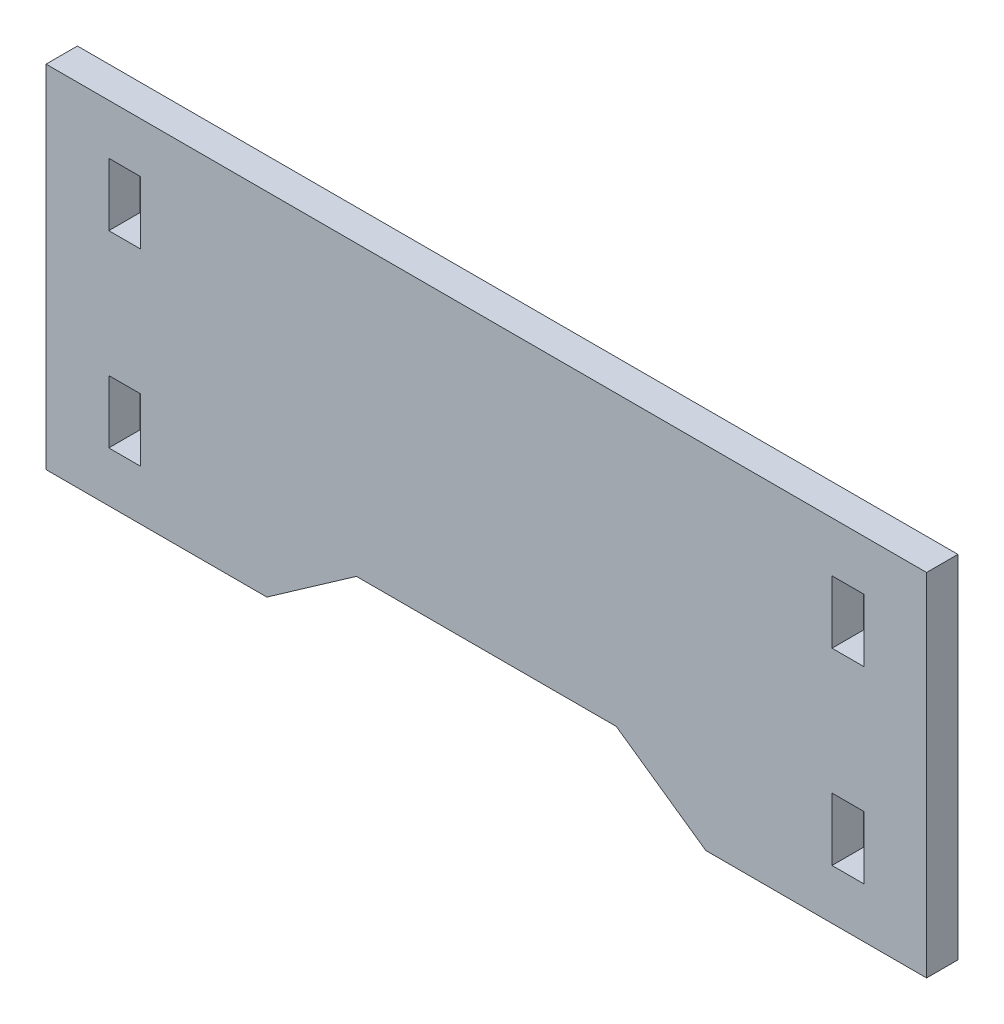
ISO-10303-21;
HEADER;
FILE_DESCRIPTION(('STEP AP214'),'2;1');
FILE_NAME('part.step','',(''),(''),'','','');
FILE_SCHEMA(('AUTOMOTIVE_DESIGN { 1 0 10303 214 1 1 1 1 }'));
ENDSEC;
DATA;
#1=APPLICATION_CONTEXT('core data for automotive mechanical design processes');
#2=APPLICATION_PROTOCOL_DEFINITION('international standard','automotive_design',2000,#1);
#3=PRODUCT_CONTEXT('',#1,'mechanical');
#4=PRODUCT('Part','Part','',(#3));
#5=PRODUCT_RELATED_PRODUCT_CATEGORY('part','',(#4));
#6=PRODUCT_DEFINITION_FORMATION('','',#4);
#7=PRODUCT_DEFINITION_CONTEXT('part definition',#1,'design');
#8=PRODUCT_DEFINITION('design','',#6,#7);
#9=PRODUCT_DEFINITION_SHAPE('','',#8);
#10=(LENGTH_UNIT() NAMED_UNIT(*) SI_UNIT(.MILLI.,.METRE.));
#11=(NAMED_UNIT(*) PLANE_ANGLE_UNIT() SI_UNIT($,.RADIAN.));
#12=(NAMED_UNIT(*) SI_UNIT($,.STERADIAN.) SOLID_ANGLE_UNIT());
#13=UNCERTAINTY_MEASURE_WITH_UNIT(LENGTH_MEASURE(1.E-05),#10,'distance_accuracy_value','');
#14=(GEOMETRIC_REPRESENTATION_CONTEXT(3) GLOBAL_UNCERTAINTY_ASSIGNED_CONTEXT((#13)) GLOBAL_UNIT_ASSIGNED_CONTEXT((#10,
#11,#12)) REPRESENTATION_CONTEXT('',''));
#15=CARTESIAN_POINT('',(0.,0.,0.));
#16=DIRECTION('',(0.,0.,1.));
#17=DIRECTION('',(1.,0.,0.));
#18=AXIS2_PLACEMENT_3D('',#15,#16,#17);
#19=CARTESIAN_POINT('',(-44.577,-17.78,3.175));
#20=DIRECTION('',(0.,1.,0.));
#21=DIRECTION('',(0.,0.,1.));
#22=AXIS2_PLACEMENT_3D('',#19,#20,#21);
#23=PLANE('',#22);
#24=DIRECTION('',(1.,0.,0.));
#25=VECTOR('',#24,1.);
#26=CARTESIAN_POINT('',(-44.577,-17.78,0.));
#27=LINE('',#26,#25);
#28=CARTESIAN_POINT('',(-44.577,-17.78,0.));
#29=VERTEX_POINT('',#28);
#30=CARTESIAN_POINT('',(-22.225,-17.78,0.));
#31=VERTEX_POINT('',#30);
#32=EDGE_CURVE('E215',#29,#31,#27,.T.);
#33=ORIENTED_EDGE('',*,*,#32,.T.);
#34=DIRECTION('',(0.,0.,1.));
#35=VECTOR('',#34,1.);
#36=CARTESIAN_POINT('',(-22.225,-17.78,0.));
#37=LINE('',#36,#35);
#38=CARTESIAN_POINT('',(-22.225,-17.78,3.175));
#39=VERTEX_POINT('',#38);
#40=EDGE_CURVE('E196',#31,#39,#37,.T.);
#41=ORIENTED_EDGE('',*,*,#40,.T.);
#42=DIRECTION('',(1.,0.,0.));
#43=VECTOR('',#42,1.);
#44=CARTESIAN_POINT('',(-44.577,-17.78,3.175));
#45=LINE('',#44,#43);
#46=CARTESIAN_POINT('',(-44.577,-17.78,3.175));
#47=VERTEX_POINT('',#46);
#48=EDGE_CURVE('E235',#47,#39,#45,.T.);
#49=ORIENTED_EDGE('',*,*,#48,.F.);
#50=DIRECTION('',(0.,0.,-1.));
#51=VECTOR('',#50,1.);
#52=CARTESIAN_POINT('',(-44.577,-17.78,3.175));
#53=LINE('',#52,#51);
#54=EDGE_CURVE('E221',#47,#29,#53,.T.);
#55=ORIENTED_EDGE('',*,*,#54,.T.);
#56=EDGE_LOOP('',(#33,#41,#49,#55));
#57=FACE_BOUND('',#56,.T.);
#58=ADVANCED_FACE('F33',(#57),#23,.F.);
#59=CARTESIAN_POINT('',(44.577,17.78,3.175));
#60=DIRECTION('',(0.,0.,-1.));
#61=DIRECTION('',(-1.,0.,0.));
#62=AXIS2_PLACEMENT_3D('',#59,#60,#61);
#63=PLANE('',#62);
#64=DIRECTION('',(0.,1.,0.));
#65=VECTOR('',#64,1.);
#66=CARTESIAN_POINT('',(35.0012,12.7,3.175));
#67=LINE('',#66,#65);
#68=CARTESIAN_POINT('',(35.0012,6.35,3.175));
#69=VERTEX_POINT('',#68);
#70=CARTESIAN_POINT('',(35.0012,12.7,3.175));
#71=VERTEX_POINT('',#70);
#72=EDGE_CURVE('E338',#69,#71,#67,.T.);
#73=ORIENTED_EDGE('',*,*,#72,.T.);
#74=DIRECTION('',(1.,0.,0.));
#75=VECTOR('',#74,1.);
#76=CARTESIAN_POINT('',(38.227,12.7,3.175));
#77=LINE('',#76,#75);
#78=CARTESIAN_POINT('',(38.227,12.7,3.175));
#79=VERTEX_POINT('',#78);
#80=EDGE_CURVE('E328',#71,#79,#77,.T.);
#81=ORIENTED_EDGE('',*,*,#80,.T.);
#82=DIRECTION('',(0.,-1.,0.));
#83=VECTOR('',#82,1.);
#84=CARTESIAN_POINT('',(38.227,12.7,3.175));
#85=LINE('',#84,#83);
#86=CARTESIAN_POINT('',(38.227,6.35,3.175));
#87=VERTEX_POINT('',#86);
#88=EDGE_CURVE('E332',#79,#87,#85,.T.);
#89=ORIENTED_EDGE('',*,*,#88,.T.);
#90=DIRECTION('',(-1.,0.,0.));
#91=VECTOR('',#90,1.);
#92=CARTESIAN_POINT('',(38.227,6.35,3.175));
#93=LINE('',#92,#91);
#94=EDGE_CURVE('E335',#87,#69,#93,.T.);
#95=ORIENTED_EDGE('',*,*,#94,.T.);
#96=EDGE_LOOP('',(#73,#81,#89,#95));
#97=FACE_BOUND('',#96,.T.);
#98=DIRECTION('',(-1.,0.,0.));
#99=VECTOR('',#98,1.);
#100=CARTESIAN_POINT('',(-38.227,-6.35,3.175));
#101=LINE('',#100,#99);
#102=CARTESIAN_POINT('',(-35.0012,-6.35,3.175));
#103=VERTEX_POINT('',#102);
#104=CARTESIAN_POINT('',(-38.227,-6.35,3.175));
#105=VERTEX_POINT('',#104);
#106=EDGE_CURVE('E302',#103,#105,#101,.T.);
#107=ORIENTED_EDGE('',*,*,#106,.F.);
#108=DIRECTION('',(0.,1.,0.));
#109=VECTOR('',#108,1.);
#110=CARTESIAN_POINT('',(-35.0012,-6.35,3.175));
#111=LINE('',#110,#109);
#112=CARTESIAN_POINT('',(-35.0012,-12.7,3.175));
#113=VERTEX_POINT('',#112);
#114=EDGE_CURVE('E305',#113,#103,#111,.T.);
#115=ORIENTED_EDGE('',*,*,#114,.F.);
#116=DIRECTION('',(1.,0.,0.));
#117=VECTOR('',#116,1.);
#118=CARTESIAN_POINT('',(-38.227,-12.7,3.175));
#119=LINE('',#118,#117);
#120=CARTESIAN_POINT('',(-38.227,-12.7,3.175));
#121=VERTEX_POINT('',#120);
#122=EDGE_CURVE('E295',#121,#113,#119,.T.);
#123=ORIENTED_EDGE('',*,*,#122,.F.);
#124=DIRECTION('',(0.,-1.,0.));
#125=VECTOR('',#124,1.);
#126=CARTESIAN_POINT('',(-38.227,-6.35,3.175));
#127=LINE('',#126,#125);
#128=EDGE_CURVE('E299',#105,#121,#127,.T.);
#129=ORIENTED_EDGE('',*,*,#128,.F.);
#130=EDGE_LOOP('',(#107,#115,#123,#129));
#131=FACE_BOUND('',#130,.T.);
#132=DIRECTION('',(-1.,0.,0.));
#133=VECTOR('',#132,1.);
#134=CARTESIAN_POINT('',(-38.227,12.7,3.175));
#135=LINE('',#134,#133);
#136=CARTESIAN_POINT('',(-35.0012,12.7,3.175));
#137=VERTEX_POINT('',#136);
#138=CARTESIAN_POINT('',(-38.227,12.7,3.175));
#139=VERTEX_POINT('',#138);
#140=EDGE_CURVE('E270',#137,#139,#135,.T.);
#141=ORIENTED_EDGE('',*,*,#140,.F.);
#142=DIRECTION('',(0.,1.,0.));
#143=VECTOR('',#142,1.);
#144=CARTESIAN_POINT('',(-35.0012,12.7,3.175));
#145=LINE('',#144,#143);
#146=CARTESIAN_POINT('',(-35.0012,6.35,3.175));
#147=VERTEX_POINT('',#146);
#148=EDGE_CURVE('E273',#147,#137,#145,.T.);
#149=ORIENTED_EDGE('',*,*,#148,.F.);
#150=DIRECTION('',(1.,0.,0.));
#151=VECTOR('',#150,1.);
#152=CARTESIAN_POINT('',(-38.227,6.35,3.175));
#153=LINE('',#152,#151);
#154=CARTESIAN_POINT('',(-38.227,6.35,3.175));
#155=VERTEX_POINT('',#154);
#156=EDGE_CURVE('E263',#155,#147,#153,.T.);
#157=ORIENTED_EDGE('',*,*,#156,.F.);
#158=DIRECTION('',(0.,-1.,0.));
#159=VECTOR('',#158,1.);
#160=CARTESIAN_POINT('',(-38.227,12.7,3.175));
#161=LINE('',#160,#159);
#162=EDGE_CURVE('E267',#139,#155,#161,.T.);
#163=ORIENTED_EDGE('',*,*,#162,.F.);
#164=EDGE_LOOP('',(#141,#149,#157,#163));
#165=FACE_BOUND('',#164,.T.);
#166=ORIENTED_EDGE('',*,*,#48,.T.);
#167=DIRECTION('',(-0.819152044288995,-0.573576436351042,0.));
#168=VECTOR('',#167,1.);
#169=CARTESIAN_POINT('',(-13.1562601571874,-11.43,3.175));
#170=LINE('',#169,#168);
#171=CARTESIAN_POINT('',(-13.1562601571874,-11.43,3.175));
#172=VERTEX_POINT('',#171);
#173=EDGE_CURVE('E202',#172,#39,#170,.T.);
#174=ORIENTED_EDGE('',*,*,#173,.F.);
#175=DIRECTION('',(-1.,0.,0.));
#176=VECTOR('',#175,1.);
#177=CARTESIAN_POINT('',(-13.1562601571874,-11.43,3.175));
#178=LINE('',#177,#176);
#179=CARTESIAN_POINT('',(13.1562601571874,-11.43,3.175));
#180=VERTEX_POINT('',#179);
#181=EDGE_CURVE('E217',#180,#172,#178,.T.);
#182=ORIENTED_EDGE('',*,*,#181,.F.);
#183=DIRECTION('',(-0.819152044288995,0.573576436351041,0.));
#184=VECTOR('',#183,1.);
#185=CARTESIAN_POINT('',(22.225,-17.78,3.175));
#186=LINE('',#185,#184);
#187=CARTESIAN_POINT('',(22.225,-17.78,3.175));
#188=VERTEX_POINT('',#187);
#189=EDGE_CURVE('E382',#188,#180,#186,.T.);
#190=ORIENTED_EDGE('',*,*,#189,.F.);
#191=CARTESIAN_POINT('',(44.577,-17.78,3.175));
#192=VERTEX_POINT('',#191);
#193=EDGE_CURVE('E251',#188,#192,#45,.T.);
#194=ORIENTED_EDGE('',*,*,#193,.T.);
#195=DIRECTION('',(0.,1.,0.));
#196=VECTOR('',#195,1.);
#197=CARTESIAN_POINT('',(44.577,-17.78,3.175));
#198=LINE('',#197,#196);
#199=CARTESIAN_POINT('',(44.577,17.78,3.175));
#200=VERTEX_POINT('',#199);
#201=EDGE_CURVE('E222',#192,#200,#198,.T.);
#202=ORIENTED_EDGE('',*,*,#201,.T.);
#203=DIRECTION('',(-1.,0.,0.));
#204=VECTOR('',#203,1.);
#205=CARTESIAN_POINT('',(-44.577,17.78,3.175));
#206=LINE('',#205,#204);
#207=CARTESIAN_POINT('',(-44.577,17.78,3.175));
#208=VERTEX_POINT('',#207);
#209=EDGE_CURVE('E226',#200,#208,#206,.T.);
#210=ORIENTED_EDGE('',*,*,#209,.T.);
#211=DIRECTION('',(0.,-1.,0.));
#212=VECTOR('',#211,1.);
#213=CARTESIAN_POINT('',(-44.577,-17.78,3.175));
#214=LINE('',#213,#212);
#215=EDGE_CURVE('E241',#208,#47,#214,.T.);
#216=ORIENTED_EDGE('',*,*,#215,.T.);
#217=EDGE_LOOP('',(#166,#174,#182,#190,#194,#202,#210,#216));
#218=FACE_BOUND('',#217,.T.);
#219=DIRECTION('',(0.,1.,0.));
#220=VECTOR('',#219,1.);
#221=CARTESIAN_POINT('',(35.0012,-6.35,3.175));
#222=LINE('',#221,#220);
#223=CARTESIAN_POINT('',(35.0012,-12.7,3.175));
#224=VERTEX_POINT('',#223);
#225=CARTESIAN_POINT('',(35.0012,-6.35,3.175));
#226=VERTEX_POINT('',#225);
#227=EDGE_CURVE('E56',#224,#226,#222,.T.);
#228=ORIENTED_EDGE('',*,*,#227,.T.);
#229=DIRECTION('',(1.,0.,0.));
#230=VECTOR('',#229,1.);
#231=CARTESIAN_POINT('',(38.227,-6.35,3.175));
#232=LINE('',#231,#230);
#233=CARTESIAN_POINT('',(38.227,-6.35,3.175));
#234=VERTEX_POINT('',#233);
#235=EDGE_CURVE('E357',#226,#234,#232,.T.);
#236=ORIENTED_EDGE('',*,*,#235,.T.);
#237=DIRECTION('',(0.,-1.,0.));
#238=VECTOR('',#237,1.);
#239=CARTESIAN_POINT('',(38.227,-6.35,3.175));
#240=LINE('',#239,#238);
#241=CARTESIAN_POINT('',(38.227,-12.7,3.175));
#242=VERTEX_POINT('',#241);
#243=EDGE_CURVE('E361',#234,#242,#240,.T.);
#244=ORIENTED_EDGE('',*,*,#243,.T.);
#245=DIRECTION('',(-1.,0.,0.));
#246=VECTOR('',#245,1.);
#247=CARTESIAN_POINT('',(38.227,-12.7,3.175));
#248=LINE('',#247,#246);
#249=EDGE_CURVE('E364',#242,#224,#248,.T.);
#250=ORIENTED_EDGE('',*,*,#249,.T.);
#251=EDGE_LOOP('',(#228,#236,#244,#250));
#252=FACE_BOUND('',#251,.T.);
#253=ADVANCED_FACE('F396',(#97,#131,#165,#218,#252),#63,.F.);
#254=CARTESIAN_POINT('',(44.577,17.78,0.));
#255=DIRECTION('',(0.,0.,-1.));
#256=DIRECTION('',(-1.,0.,0.));
#257=AXIS2_PLACEMENT_3D('',#254,#255,#256);
#258=PLANE('',#257);
#259=DIRECTION('',(-0.819152044288995,-0.573576436351042,0.));
#260=VECTOR('',#259,1.);
#261=CARTESIAN_POINT('',(-13.1562601571874,-11.43,0.));
#262=LINE('',#261,#260);
#263=CARTESIAN_POINT('',(-13.1562601571874,-11.43,0.));
#264=VERTEX_POINT('',#263);
#265=EDGE_CURVE('E199',#264,#31,#262,.T.);
#266=ORIENTED_EDGE('',*,*,#265,.T.);
#267=ORIENTED_EDGE('',*,*,#32,.F.);
#268=DIRECTION('',(0.,-1.,0.));
#269=VECTOR('',#268,1.);
#270=CARTESIAN_POINT('',(-44.577,-17.78,0.));
#271=LINE('',#270,#269);
#272=CARTESIAN_POINT('',(-44.577,17.78,0.));
#273=VERTEX_POINT('',#272);
#274=EDGE_CURVE('E228',#273,#29,#271,.T.);
#275=ORIENTED_EDGE('',*,*,#274,.F.);
#276=DIRECTION('',(-1.,0.,0.));
#277=VECTOR('',#276,1.);
#278=CARTESIAN_POINT('',(-44.577,17.78,0.));
#279=LINE('',#278,#277);
#280=CARTESIAN_POINT('',(44.577,17.78,0.));
#281=VERTEX_POINT('',#280);
#282=EDGE_CURVE('E244',#281,#273,#279,.T.);
#283=ORIENTED_EDGE('',*,*,#282,.F.);
#284=DIRECTION('',(0.,1.,0.));
#285=VECTOR('',#284,1.);
#286=CARTESIAN_POINT('',(44.577,-17.78,0.));
#287=LINE('',#286,#285);
#288=CARTESIAN_POINT('',(44.577,-17.78,0.));
#289=VERTEX_POINT('',#288);
#290=EDGE_CURVE('E245',#289,#281,#287,.T.);
#291=ORIENTED_EDGE('',*,*,#290,.F.);
#292=CARTESIAN_POINT('',(22.225,-17.78,0.));
#293=VERTEX_POINT('',#292);
#294=EDGE_CURVE('E223',#293,#289,#27,.T.);
#295=ORIENTED_EDGE('',*,*,#294,.F.);
#296=DIRECTION('',(-0.819152044288995,0.573576436351041,0.));
#297=VECTOR('',#296,1.);
#298=CARTESIAN_POINT('',(22.225,-17.78,0.));
#299=LINE('',#298,#297);
#300=CARTESIAN_POINT('',(13.1562601571874,-11.43,0.));
#301=VERTEX_POINT('',#300);
#302=EDGE_CURVE('E48',#293,#301,#299,.T.);
#303=ORIENTED_EDGE('',*,*,#302,.T.);
#304=DIRECTION('',(-1.,0.,0.));
#305=VECTOR('',#304,1.);
#306=CARTESIAN_POINT('',(-13.1562601571874,-11.43,0.));
#307=LINE('',#306,#305);
#308=EDGE_CURVE('E208',#301,#264,#307,.T.);
#309=ORIENTED_EDGE('',*,*,#308,.T.);
#310=EDGE_LOOP('',(#266,#267,#275,#283,#291,#295,#303,#309));
#311=FACE_BOUND('',#310,.T.);
#312=DIRECTION('',(1.,0.,0.));
#313=VECTOR('',#312,1.);
#314=CARTESIAN_POINT('',(38.227,12.7,0.));
#315=LINE('',#314,#313);
#316=CARTESIAN_POINT('',(35.0012,12.7,0.));
#317=VERTEX_POINT('',#316);
#318=CARTESIAN_POINT('',(38.227,12.7,0.));
#319=VERTEX_POINT('',#318);
#320=EDGE_CURVE('E322',#317,#319,#315,.T.);
#321=ORIENTED_EDGE('',*,*,#320,.F.);
#322=DIRECTION('',(0.,1.,0.));
#323=VECTOR('',#322,1.);
#324=CARTESIAN_POINT('',(35.0012,12.7,0.));
#325=LINE('',#324,#323);
#326=CARTESIAN_POINT('',(35.0012,6.35,0.));
#327=VERTEX_POINT('',#326);
#328=EDGE_CURVE('E331',#327,#317,#325,.T.);
#329=ORIENTED_EDGE('',*,*,#328,.F.);
#330=DIRECTION('',(-1.,0.,0.));
#331=VECTOR('',#330,1.);
#332=CARTESIAN_POINT('',(38.227,6.35,0.));
#333=LINE('',#332,#331);
#334=CARTESIAN_POINT('',(38.227,6.35,0.));
#335=VERTEX_POINT('',#334);
#336=EDGE_CURVE('E346',#335,#327,#333,.T.);
#337=ORIENTED_EDGE('',*,*,#336,.F.);
#338=DIRECTION('',(0.,-1.,0.));
#339=VECTOR('',#338,1.);
#340=CARTESIAN_POINT('',(38.227,12.7,0.));
#341=LINE('',#340,#339);
#342=EDGE_CURVE('E343',#319,#335,#341,.T.);
#343=ORIENTED_EDGE('',*,*,#342,.F.);
#344=EDGE_LOOP('',(#321,#329,#337,#343));
#345=FACE_BOUND('',#344,.T.);
#346=DIRECTION('',(0.,1.,0.));
#347=VECTOR('',#346,1.);
#348=CARTESIAN_POINT('',(-35.0012,-6.35,0.));
#349=LINE('',#348,#347);
#350=CARTESIAN_POINT('',(-35.0012,-12.7,0.));
#351=VERTEX_POINT('',#350);
#352=CARTESIAN_POINT('',(-35.0012,-6.35,0.));
#353=VERTEX_POINT('',#352);
#354=EDGE_CURVE('E298',#351,#353,#349,.T.);
#355=ORIENTED_EDGE('',*,*,#354,.T.);
#356=DIRECTION('',(-1.,0.,0.));
#357=VECTOR('',#356,1.);
#358=CARTESIAN_POINT('',(-38.227,-6.35,0.));
#359=LINE('',#358,#357);
#360=CARTESIAN_POINT('',(-38.227,-6.35,0.));
#361=VERTEX_POINT('',#360);
#362=EDGE_CURVE('E313',#353,#361,#359,.T.);
#363=ORIENTED_EDGE('',*,*,#362,.T.);
#364=DIRECTION('',(0.,-1.,0.));
#365=VECTOR('',#364,1.);
#366=CARTESIAN_POINT('',(-38.227,-6.35,0.));
#367=LINE('',#366,#365);
#368=CARTESIAN_POINT('',(-38.227,-12.7,0.));
#369=VERTEX_POINT('',#368);
#370=EDGE_CURVE('E310',#361,#369,#367,.T.);
#371=ORIENTED_EDGE('',*,*,#370,.T.);
#372=DIRECTION('',(1.,0.,0.));
#373=VECTOR('',#372,1.);
#374=CARTESIAN_POINT('',(-38.227,-12.7,0.));
#375=LINE('',#374,#373);
#376=EDGE_CURVE('E290',#369,#351,#375,.T.);
#377=ORIENTED_EDGE('',*,*,#376,.T.);
#378=EDGE_LOOP('',(#355,#363,#371,#377));
#379=FACE_BOUND('',#378,.T.);
#380=DIRECTION('',(0.,1.,0.));
#381=VECTOR('',#380,1.);
#382=CARTESIAN_POINT('',(-35.0012,12.7,0.));
#383=LINE('',#382,#381);
#384=CARTESIAN_POINT('',(-35.0012,6.35,0.));
#385=VERTEX_POINT('',#384);
#386=CARTESIAN_POINT('',(-35.0012,12.7,0.));
#387=VERTEX_POINT('',#386);
#388=EDGE_CURVE('E266',#385,#387,#383,.T.);
#389=ORIENTED_EDGE('',*,*,#388,.T.);
#390=DIRECTION('',(-1.,0.,0.));
#391=VECTOR('',#390,1.);
#392=CARTESIAN_POINT('',(-38.227,12.7,0.));
#393=LINE('',#392,#391);
#394=CARTESIAN_POINT('',(-38.227,12.7,0.));
#395=VERTEX_POINT('',#394);
#396=EDGE_CURVE('E281',#387,#395,#393,.T.);
#397=ORIENTED_EDGE('',*,*,#396,.T.);
#398=DIRECTION('',(0.,-1.,0.));
#399=VECTOR('',#398,1.);
#400=CARTESIAN_POINT('',(-38.227,12.7,0.));
#401=LINE('',#400,#399);
#402=CARTESIAN_POINT('',(-38.227,6.35,0.));
#403=VERTEX_POINT('',#402);
#404=EDGE_CURVE('E278',#395,#403,#401,.T.);
#405=ORIENTED_EDGE('',*,*,#404,.T.);
#406=DIRECTION('',(1.,0.,0.));
#407=VECTOR('',#406,1.);
#408=CARTESIAN_POINT('',(-38.227,6.35,0.));
#409=LINE('',#408,#407);
#410=EDGE_CURVE('E258',#403,#385,#409,.T.);
#411=ORIENTED_EDGE('',*,*,#410,.T.);
#412=EDGE_LOOP('',(#389,#397,#405,#411));
#413=FACE_BOUND('',#412,.T.);
#414=DIRECTION('',(1.,0.,0.));
#415=VECTOR('',#414,1.);
#416=CARTESIAN_POINT('',(38.227,-6.35,0.));
#417=LINE('',#416,#415);
#418=CARTESIAN_POINT('',(35.0012,-6.35,0.));
#419=VERTEX_POINT('',#418);
#420=CARTESIAN_POINT('',(38.227,-6.35,0.));
#421=VERTEX_POINT('',#420);
#422=EDGE_CURVE('E352',#419,#421,#417,.T.);
#423=ORIENTED_EDGE('',*,*,#422,.F.);
#424=DIRECTION('',(0.,1.,0.));
#425=VECTOR('',#424,1.);
#426=CARTESIAN_POINT('',(35.0012,-6.35,0.));
#427=LINE('',#426,#425);
#428=CARTESIAN_POINT('',(35.0012,-12.7,0.));
#429=VERTEX_POINT('',#428);
#430=EDGE_CURVE('E360',#429,#419,#427,.T.);
#431=ORIENTED_EDGE('',*,*,#430,.F.);
#432=DIRECTION('',(-1.,0.,0.));
#433=VECTOR('',#432,1.);
#434=CARTESIAN_POINT('',(38.227,-12.7,0.));
#435=LINE('',#434,#433);
#436=CARTESIAN_POINT('',(38.227,-12.7,0.));
#437=VERTEX_POINT('',#436);
#438=EDGE_CURVE('E373',#437,#429,#435,.T.);
#439=ORIENTED_EDGE('',*,*,#438,.F.);
#440=DIRECTION('',(0.,-1.,0.));
#441=VECTOR('',#440,1.);
#442=CARTESIAN_POINT('',(38.227,-6.35,0.));
#443=LINE('',#442,#441);
#444=EDGE_CURVE('E370',#421,#437,#443,.T.);
#445=ORIENTED_EDGE('',*,*,#444,.F.);
#446=EDGE_LOOP('',(#423,#431,#439,#445));
#447=FACE_BOUND('',#446,.T.);
#448=ADVANCED_FACE('F212',(#311,#345,#379,#413,#447),#258,.T.);
#449=CARTESIAN_POINT('',(44.577,-17.78,3.175));
#450=DIRECTION('',(-1.,0.,0.));
#451=DIRECTION('',(0.,0.,1.));
#452=AXIS2_PLACEMENT_3D('',#449,#450,#451);
#453=PLANE('',#452);
#454=ORIENTED_EDGE('',*,*,#290,.T.);
#455=DIRECTION('',(0.,0.,-1.));
#456=VECTOR('',#455,1.);
#457=CARTESIAN_POINT('',(44.577,17.78,3.175));
#458=LINE('',#457,#456);
#459=EDGE_CURVE('E11',#200,#281,#458,.T.);
#460=ORIENTED_EDGE('',*,*,#459,.F.);
#461=ORIENTED_EDGE('',*,*,#201,.F.);
#462=DIRECTION('',(0.,0.,-1.));
#463=VECTOR('',#462,1.);
#464=CARTESIAN_POINT('',(44.577,-17.78,3.175));
#465=LINE('',#464,#463);
#466=EDGE_CURVE('E232',#192,#289,#465,.T.);
#467=ORIENTED_EDGE('',*,*,#466,.T.);
#468=EDGE_LOOP('',(#454,#460,#461,#467));
#469=FACE_BOUND('',#468,.T.);
#470=ADVANCED_FACE('F35',(#469),#453,.F.);
#471=CARTESIAN_POINT('',(-44.577,17.78,3.175));
#472=DIRECTION('',(0.,-1.,0.));
#473=DIRECTION('',(0.,0.,-1.));
#474=AXIS2_PLACEMENT_3D('',#471,#472,#473);
#475=PLANE('',#474);
#476=ORIENTED_EDGE('',*,*,#282,.T.);
#477=DIRECTION('',(0.,0.,-1.));
#478=VECTOR('',#477,1.);
#479=CARTESIAN_POINT('',(-44.577,17.78,3.175));
#480=LINE('',#479,#478);
#481=EDGE_CURVE('E41',#208,#273,#480,.T.);
#482=ORIENTED_EDGE('',*,*,#481,.F.);
#483=ORIENTED_EDGE('',*,*,#209,.F.);
#484=ORIENTED_EDGE('',*,*,#459,.T.);
#485=EDGE_LOOP('',(#476,#482,#483,#484));
#486=FACE_BOUND('',#485,.T.);
#487=ADVANCED_FACE('F430',(#486),#475,.F.);
#488=CARTESIAN_POINT('',(-44.577,-17.78,3.175));
#489=DIRECTION('',(1.,0.,0.));
#490=DIRECTION('',(0.,0.,-1.));
#491=AXIS2_PLACEMENT_3D('',#488,#489,#490);
#492=PLANE('',#491);
#493=ORIENTED_EDGE('',*,*,#274,.T.);
#494=ORIENTED_EDGE('',*,*,#54,.F.);
#495=ORIENTED_EDGE('',*,*,#215,.F.);
#496=ORIENTED_EDGE('',*,*,#481,.T.);
#497=EDGE_LOOP('',(#493,#494,#495,#496));
#498=FACE_BOUND('',#497,.T.);
#499=ADVANCED_FACE('F240',(#498),#492,.F.);
#500=ORIENTED_EDGE('',*,*,#193,.F.);
#501=DIRECTION('',(0.,0.,1.));
#502=VECTOR('',#501,1.);
#503=CARTESIAN_POINT('',(22.225,-17.78,0.));
#504=LINE('',#503,#502);
#505=EDGE_CURVE('E207',#293,#188,#504,.T.);
#506=ORIENTED_EDGE('',*,*,#505,.F.);
#507=ORIENTED_EDGE('',*,*,#294,.T.);
#508=ORIENTED_EDGE('',*,*,#466,.F.);
#509=EDGE_LOOP('',(#500,#506,#507,#508));
#510=FACE_BOUND('',#509,.T.);
#511=ADVANCED_FACE('F391',(#510),#23,.F.);
#512=CARTESIAN_POINT('',(-35.0012,12.7,0.));
#513=DIRECTION('',(1.,0.,0.));
#514=DIRECTION('',(0.,0.,-1.));
#515=AXIS2_PLACEMENT_3D('',#512,#513,#514);
#516=PLANE('',#515);
#517=ORIENTED_EDGE('',*,*,#148,.T.);
#518=DIRECTION('',(0.,0.,1.));
#519=VECTOR('',#518,1.);
#520=CARTESIAN_POINT('',(-35.0012,12.7,0.));
#521=LINE('',#520,#519);
#522=EDGE_CURVE('E254',#387,#137,#521,.T.);
#523=ORIENTED_EDGE('',*,*,#522,.F.);
#524=ORIENTED_EDGE('',*,*,#388,.F.);
#525=DIRECTION('',(0.,0.,1.));
#526=VECTOR('',#525,1.);
#527=CARTESIAN_POINT('',(-35.0012,6.35,0.));
#528=LINE('',#527,#526);
#529=EDGE_CURVE('E247',#385,#147,#528,.T.);
#530=ORIENTED_EDGE('',*,*,#529,.T.);
#531=EDGE_LOOP('',(#517,#523,#524,#530));
#532=FACE_BOUND('',#531,.T.);
#533=ADVANCED_FACE('F422',(#532),#516,.F.);
#534=CARTESIAN_POINT('',(-38.227,6.35,0.));
#535=DIRECTION('',(0.,-1.,0.));
#536=DIRECTION('',(0.,0.,-1.));
#537=AXIS2_PLACEMENT_3D('',#534,#535,#536);
#538=PLANE('',#537);
#539=ORIENTED_EDGE('',*,*,#156,.T.);
#540=ORIENTED_EDGE('',*,*,#529,.F.);
#541=ORIENTED_EDGE('',*,*,#410,.F.);
#542=DIRECTION('',(0.,0.,1.));
#543=VECTOR('',#542,1.);
#544=CARTESIAN_POINT('',(-38.227,6.35,0.));
#545=LINE('',#544,#543);
#546=EDGE_CURVE('E260',#403,#155,#545,.T.);
#547=ORIENTED_EDGE('',*,*,#546,.T.);
#548=EDGE_LOOP('',(#539,#540,#541,#547));
#549=FACE_BOUND('',#548,.T.);
#550=ADVANCED_FACE('F427',(#549),#538,.F.);
#551=CARTESIAN_POINT('',(-38.227,12.7,0.));
#552=DIRECTION('',(-1.,0.,0.));
#553=DIRECTION('',(0.,0.,1.));
#554=AXIS2_PLACEMENT_3D('',#551,#552,#553);
#555=PLANE('',#554);
#556=ORIENTED_EDGE('',*,*,#162,.T.);
#557=ORIENTED_EDGE('',*,*,#546,.F.);
#558=ORIENTED_EDGE('',*,*,#404,.F.);
#559=DIRECTION('',(0.,0.,1.));
#560=VECTOR('',#559,1.);
#561=CARTESIAN_POINT('',(-38.227,12.7,0.));
#562=LINE('',#561,#560);
#563=EDGE_CURVE('E257',#395,#139,#562,.T.);
#564=ORIENTED_EDGE('',*,*,#563,.T.);
#565=EDGE_LOOP('',(#556,#557,#558,#564));
#566=FACE_BOUND('',#565,.T.);
#567=ADVANCED_FACE('F447',(#566),#555,.F.);
#568=CARTESIAN_POINT('',(-38.227,12.7,0.));
#569=DIRECTION('',(0.,1.,0.));
#570=DIRECTION('',(0.,0.,1.));
#571=AXIS2_PLACEMENT_3D('',#568,#569,#570);
#572=PLANE('',#571);
#573=ORIENTED_EDGE('',*,*,#140,.T.);
#574=ORIENTED_EDGE('',*,*,#563,.F.);
#575=ORIENTED_EDGE('',*,*,#396,.F.);
#576=ORIENTED_EDGE('',*,*,#522,.T.);
#577=EDGE_LOOP('',(#573,#574,#575,#576));
#578=FACE_BOUND('',#577,.T.);
#579=ADVANCED_FACE('F443',(#578),#572,.F.);
#580=CARTESIAN_POINT('',(-35.0012,-6.35,0.));
#581=DIRECTION('',(1.,0.,0.));
#582=DIRECTION('',(0.,0.,-1.));
#583=AXIS2_PLACEMENT_3D('',#580,#581,#582);
#584=PLANE('',#583);
#585=ORIENTED_EDGE('',*,*,#114,.T.);
#586=DIRECTION('',(0.,0.,1.));
#587=VECTOR('',#586,1.);
#588=CARTESIAN_POINT('',(-35.0012,-6.35,0.));
#589=LINE('',#588,#587);
#590=EDGE_CURVE('E286',#353,#103,#589,.T.);
#591=ORIENTED_EDGE('',*,*,#590,.F.);
#592=ORIENTED_EDGE('',*,*,#354,.F.);
#593=DIRECTION('',(0.,0.,1.));
#594=VECTOR('',#593,1.);
#595=CARTESIAN_POINT('',(-35.0012,-12.7,0.));
#596=LINE('',#595,#594);
#597=EDGE_CURVE('E275',#351,#113,#596,.T.);
#598=ORIENTED_EDGE('',*,*,#597,.T.);
#599=EDGE_LOOP('',(#585,#591,#592,#598));
#600=FACE_BOUND('',#599,.T.);
#601=ADVANCED_FACE('F446',(#600),#584,.F.);
#602=CARTESIAN_POINT('',(-38.227,-12.7,0.));
#603=DIRECTION('',(0.,-1.,0.));
#604=DIRECTION('',(0.,0.,-1.));
#605=AXIS2_PLACEMENT_3D('',#602,#603,#604);
#606=PLANE('',#605);
#607=ORIENTED_EDGE('',*,*,#122,.T.);
#608=ORIENTED_EDGE('',*,*,#597,.F.);
#609=ORIENTED_EDGE('',*,*,#376,.F.);
#610=DIRECTION('',(0.,0.,1.));
#611=VECTOR('',#610,1.);
#612=CARTESIAN_POINT('',(-38.227,-12.7,0.));
#613=LINE('',#612,#611);
#614=EDGE_CURVE('E292',#369,#121,#613,.T.);
#615=ORIENTED_EDGE('',*,*,#614,.T.);
#616=EDGE_LOOP('',(#607,#608,#609,#615));
#617=FACE_BOUND('',#616,.T.);
#618=ADVANCED_FACE('F457',(#617),#606,.F.);
#619=CARTESIAN_POINT('',(-38.227,-6.35,0.));
#620=DIRECTION('',(-1.,0.,0.));
#621=DIRECTION('',(0.,-1.,0.));
#622=AXIS2_PLACEMENT_3D('',#619,#620,#621);
#623=PLANE('',#622);
#624=ORIENTED_EDGE('',*,*,#128,.T.);
#625=ORIENTED_EDGE('',*,*,#614,.F.);
#626=ORIENTED_EDGE('',*,*,#370,.F.);
#627=DIRECTION('',(0.,0.,1.));
#628=VECTOR('',#627,1.);
#629=CARTESIAN_POINT('',(-38.227,-6.35,0.));
#630=LINE('',#629,#628);
#631=EDGE_CURVE('E289',#361,#105,#630,.T.);
#632=ORIENTED_EDGE('',*,*,#631,.T.);
#633=EDGE_LOOP('',(#624,#625,#626,#632));
#634=FACE_BOUND('',#633,.T.);
#635=ADVANCED_FACE('F463',(#634),#623,.F.);
#636=CARTESIAN_POINT('',(-38.227,-6.35,0.));
#637=DIRECTION('',(0.,1.,0.));
#638=DIRECTION('',(0.,0.,1.));
#639=AXIS2_PLACEMENT_3D('',#636,#637,#638);
#640=PLANE('',#639);
#641=ORIENTED_EDGE('',*,*,#106,.T.);
#642=ORIENTED_EDGE('',*,*,#631,.F.);
#643=ORIENTED_EDGE('',*,*,#362,.F.);
#644=ORIENTED_EDGE('',*,*,#590,.T.);
#645=EDGE_LOOP('',(#641,#642,#643,#644));
#646=FACE_BOUND('',#645,.T.);
#647=ADVANCED_FACE('F459',(#646),#640,.F.);
#648=CARTESIAN_POINT('',(35.0012,12.7,0.));
#649=DIRECTION('',(1.,0.,0.));
#650=DIRECTION('',(0.,0.,-1.));
#651=AXIS2_PLACEMENT_3D('',#648,#649,#650);
#652=PLANE('',#651);
#653=ORIENTED_EDGE('',*,*,#72,.F.);
#654=DIRECTION('',(0.,0.,1.));
#655=VECTOR('',#654,1.);
#656=CARTESIAN_POINT('',(35.0012,6.35,0.));
#657=LINE('',#656,#655);
#658=EDGE_CURVE('E318',#327,#69,#657,.T.);
#659=ORIENTED_EDGE('',*,*,#658,.F.);
#660=ORIENTED_EDGE('',*,*,#328,.T.);
#661=DIRECTION('',(0.,0.,1.));
#662=VECTOR('',#661,1.);
#663=CARTESIAN_POINT('',(35.0012,12.7,0.));
#664=LINE('',#663,#662);
#665=EDGE_CURVE('E307',#317,#71,#664,.T.);
#666=ORIENTED_EDGE('',*,*,#665,.T.);
#667=EDGE_LOOP('',(#653,#659,#660,#666));
#668=FACE_BOUND('',#667,.T.);
#669=ADVANCED_FACE('F462',(#668),#652,.T.);
#670=CARTESIAN_POINT('',(38.227,12.7,0.));
#671=DIRECTION('',(0.,-1.,0.));
#672=DIRECTION('',(0.,0.,-1.));
#673=AXIS2_PLACEMENT_3D('',#670,#671,#672);
#674=PLANE('',#673);
#675=ORIENTED_EDGE('',*,*,#80,.F.);
#676=ORIENTED_EDGE('',*,*,#665,.F.);
#677=ORIENTED_EDGE('',*,*,#320,.T.);
#678=DIRECTION('',(0.,0.,1.));
#679=VECTOR('',#678,1.);
#680=CARTESIAN_POINT('',(38.227,12.7,0.));
#681=LINE('',#680,#679);
#682=EDGE_CURVE('E324',#319,#79,#681,.T.);
#683=ORIENTED_EDGE('',*,*,#682,.T.);
#684=EDGE_LOOP('',(#675,#676,#677,#683));
#685=FACE_BOUND('',#684,.T.);
#686=ADVANCED_FACE('F473',(#685),#674,.T.);
#687=CARTESIAN_POINT('',(38.227,12.7,0.));
#688=DIRECTION('',(-1.,0.,0.));
#689=DIRECTION('',(0.,0.,1.));
#690=AXIS2_PLACEMENT_3D('',#687,#688,#689);
#691=PLANE('',#690);
#692=ORIENTED_EDGE('',*,*,#88,.F.);
#693=ORIENTED_EDGE('',*,*,#682,.F.);
#694=ORIENTED_EDGE('',*,*,#342,.T.);
#695=DIRECTION('',(0.,0.,1.));
#696=VECTOR('',#695,1.);
#697=CARTESIAN_POINT('',(38.227,6.35,0.));
#698=LINE('',#697,#696);
#699=EDGE_CURVE('E321',#335,#87,#698,.T.);
#700=ORIENTED_EDGE('',*,*,#699,.T.);
#701=EDGE_LOOP('',(#692,#693,#694,#700));
#702=FACE_BOUND('',#701,.T.);
#703=ADVANCED_FACE('F479',(#702),#691,.T.);
#704=CARTESIAN_POINT('',(38.227,6.35,0.));
#705=DIRECTION('',(0.,1.,0.));
#706=DIRECTION('',(0.,0.,1.));
#707=AXIS2_PLACEMENT_3D('',#704,#705,#706);
#708=PLANE('',#707);
#709=ORIENTED_EDGE('',*,*,#94,.F.);
#710=ORIENTED_EDGE('',*,*,#699,.F.);
#711=ORIENTED_EDGE('',*,*,#336,.T.);
#712=ORIENTED_EDGE('',*,*,#658,.T.);
#713=EDGE_LOOP('',(#709,#710,#711,#712));
#714=FACE_BOUND('',#713,.T.);
#715=ADVANCED_FACE('F475',(#714),#708,.T.);
#716=CARTESIAN_POINT('',(35.0012,-6.35,0.));
#717=DIRECTION('',(1.,0.,0.));
#718=DIRECTION('',(0.,0.,-1.));
#719=AXIS2_PLACEMENT_3D('',#716,#717,#718);
#720=PLANE('',#719);
#721=ORIENTED_EDGE('',*,*,#227,.F.);
#722=DIRECTION('',(0.,0.,1.));
#723=VECTOR('',#722,1.);
#724=CARTESIAN_POINT('',(35.0012,-12.7,0.));
#725=LINE('',#724,#723);
#726=EDGE_CURVE('E349',#429,#224,#725,.T.);
#727=ORIENTED_EDGE('',*,*,#726,.F.);
#728=ORIENTED_EDGE('',*,*,#430,.T.);
#729=DIRECTION('',(0.,0.,1.));
#730=VECTOR('',#729,1.);
#731=CARTESIAN_POINT('',(35.0012,-6.35,0.));
#732=LINE('',#731,#730);
#733=EDGE_CURVE('E341',#419,#226,#732,.T.);
#734=ORIENTED_EDGE('',*,*,#733,.T.);
#735=EDGE_LOOP('',(#721,#727,#728,#734));
#736=FACE_BOUND('',#735,.T.);
#737=ADVANCED_FACE('F478',(#736),#720,.T.);
#738=CARTESIAN_POINT('',(38.227,-6.35,0.));
#739=DIRECTION('',(0.,-1.,0.));
#740=DIRECTION('',(0.,0.,-1.));
#741=AXIS2_PLACEMENT_3D('',#738,#739,#740);
#742=PLANE('',#741);
#743=ORIENTED_EDGE('',*,*,#235,.F.);
#744=ORIENTED_EDGE('',*,*,#733,.F.);
#745=ORIENTED_EDGE('',*,*,#422,.T.);
#746=DIRECTION('',(0.,0.,1.));
#747=VECTOR('',#746,1.);
#748=CARTESIAN_POINT('',(38.227,-6.35,0.));
#749=LINE('',#748,#747);
#750=EDGE_CURVE('E354',#421,#234,#749,.T.);
#751=ORIENTED_EDGE('',*,*,#750,.T.);
#752=EDGE_LOOP('',(#743,#744,#745,#751));
#753=FACE_BOUND('',#752,.T.);
#754=ADVANCED_FACE('F489',(#753),#742,.T.);
#755=CARTESIAN_POINT('',(38.227,-6.35,0.));
#756=DIRECTION('',(-1.,0.,0.));
#757=DIRECTION('',(0.,-1.,0.));
#758=AXIS2_PLACEMENT_3D('',#755,#756,#757);
#759=PLANE('',#758);
#760=ORIENTED_EDGE('',*,*,#243,.F.);
#761=ORIENTED_EDGE('',*,*,#750,.F.);
#762=ORIENTED_EDGE('',*,*,#444,.T.);
#763=DIRECTION('',(0.,0.,1.));
#764=VECTOR('',#763,1.);
#765=CARTESIAN_POINT('',(38.227,-12.7,0.));
#766=LINE('',#765,#764);
#767=EDGE_CURVE('E351',#437,#242,#766,.T.);
#768=ORIENTED_EDGE('',*,*,#767,.T.);
#769=EDGE_LOOP('',(#760,#761,#762,#768));
#770=FACE_BOUND('',#769,.T.);
#771=ADVANCED_FACE('F492',(#770),#759,.T.);
#772=CARTESIAN_POINT('',(38.227,-12.7,0.));
#773=DIRECTION('',(0.,1.,0.));
#774=DIRECTION('',(0.,0.,1.));
#775=AXIS2_PLACEMENT_3D('',#772,#773,#774);
#776=PLANE('',#775);
#777=ORIENTED_EDGE('',*,*,#249,.F.);
#778=ORIENTED_EDGE('',*,*,#767,.F.);
#779=ORIENTED_EDGE('',*,*,#438,.T.);
#780=ORIENTED_EDGE('',*,*,#726,.T.);
#781=EDGE_LOOP('',(#777,#778,#779,#780));
#782=FACE_BOUND('',#781,.T.);
#783=ADVANCED_FACE('F410',(#782),#776,.T.);
#784=CARTESIAN_POINT('',(-13.1562601571874,-11.43,0.));
#785=DIRECTION('',(-0.573576436351042,0.819152044288995,0.));
#786=DIRECTION('',(-0.819152044288995,-0.573576436351042,0.));
#787=AXIS2_PLACEMENT_3D('',#784,#785,#786);
#788=PLANE('',#787);
#789=ORIENTED_EDGE('',*,*,#173,.T.);
#790=ORIENTED_EDGE('',*,*,#40,.F.);
#791=ORIENTED_EDGE('',*,*,#265,.F.);
#792=DIRECTION('',(0.,0.,1.));
#793=VECTOR('',#792,1.);
#794=CARTESIAN_POINT('',(-13.1562601571874,-11.43,0.));
#795=LINE('',#794,#793);
#796=EDGE_CURVE('E368',#264,#172,#795,.T.);
#797=ORIENTED_EDGE('',*,*,#796,.T.);
#798=EDGE_LOOP('',(#789,#790,#791,#797));
#799=FACE_BOUND('',#798,.T.);
#800=ADVANCED_FACE('F198',(#799),#788,.F.);
#801=CARTESIAN_POINT('',(-13.1562601571874,-11.43,0.));
#802=DIRECTION('',(0.,1.,0.));
#803=DIRECTION('',(0.,0.,1.));
#804=AXIS2_PLACEMENT_3D('',#801,#802,#803);
#805=PLANE('',#804);
#806=ORIENTED_EDGE('',*,*,#181,.T.);
#807=ORIENTED_EDGE('',*,*,#796,.F.);
#808=ORIENTED_EDGE('',*,*,#308,.F.);
#809=DIRECTION('',(0.,0.,1.));
#810=VECTOR('',#809,1.);
#811=CARTESIAN_POINT('',(13.1562601571874,-11.43,0.));
#812=LINE('',#811,#810);
#813=EDGE_CURVE('E377',#301,#180,#812,.T.);
#814=ORIENTED_EDGE('',*,*,#813,.T.);
#815=EDGE_LOOP('',(#806,#807,#808,#814));
#816=FACE_BOUND('',#815,.T.);
#817=ADVANCED_FACE('F402',(#816),#805,.F.);
#818=CARTESIAN_POINT('',(22.225,-17.78,0.));
#819=DIRECTION('',(0.573576436351041,0.819152044288995,0.));
#820=DIRECTION('',(-0.819152044288995,0.573576436351041,0.));
#821=AXIS2_PLACEMENT_3D('',#818,#819,#820);
#822=PLANE('',#821);
#823=ORIENTED_EDGE('',*,*,#189,.T.);
#824=ORIENTED_EDGE('',*,*,#813,.F.);
#825=ORIENTED_EDGE('',*,*,#302,.F.);
#826=ORIENTED_EDGE('',*,*,#505,.T.);
#827=EDGE_LOOP('',(#823,#824,#825,#826));
#828=FACE_BOUND('',#827,.T.);
#829=ADVANCED_FACE('F400',(#828),#822,.F.);
#830=CLOSED_SHELL('',(#58,#253,#448,#470,#487,#499,#511,#533,#550,#567,#579,#601,#618,#635,#647,
#669,#686,#703,#715,#737,#754,#771,#783,#800,#817,#829));
#831=MANIFOLD_SOLID_BREP('B2',#830);
#832=ADVANCED_BREP_SHAPE_REPRESENTATION('',(#18,#831),#14);
#833=SHAPE_DEFINITION_REPRESENTATION(#9,#832);
ENDSEC;
END-ISO-10303-21;
